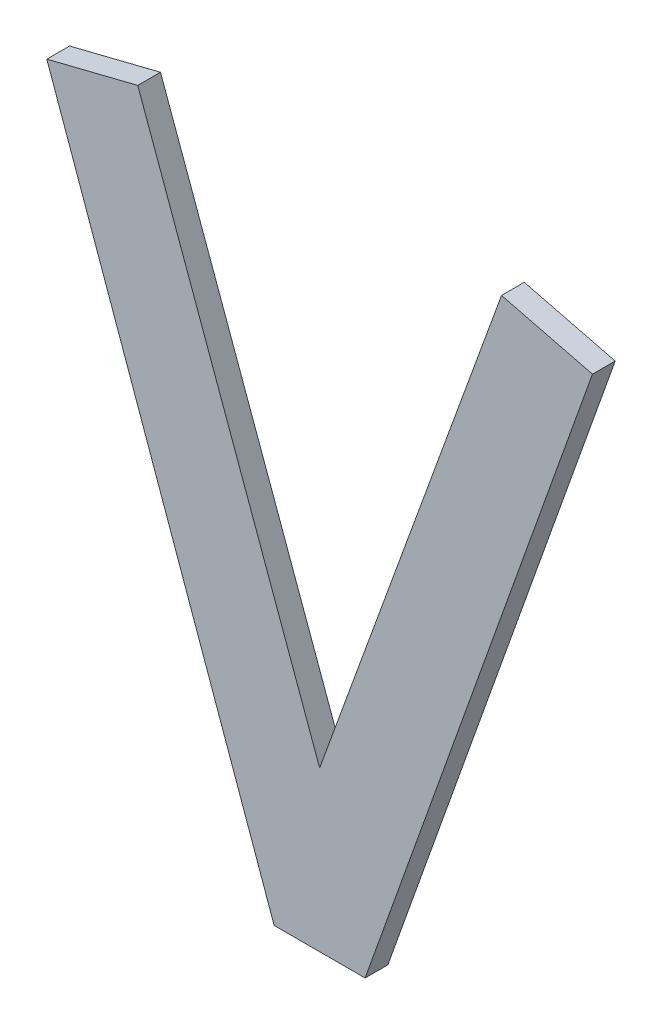
ISO-10303-21;
HEADER;
FILE_DESCRIPTION(('STEP AP214'),'2;1');
FILE_NAME('part.step','',(''),(''),'','','');
FILE_SCHEMA(('AUTOMOTIVE_DESIGN { 1 0 10303 214 1 1 1 1 }'));
ENDSEC;
DATA;
#1=APPLICATION_CONTEXT('core data for automotive mechanical design processes');
#2=APPLICATION_PROTOCOL_DEFINITION('international standard','automotive_design',2000,#1);
#3=PRODUCT_CONTEXT('',#1,'mechanical');
#4=PRODUCT('Part','Part','',(#3));
#5=PRODUCT_RELATED_PRODUCT_CATEGORY('part','',(#4));
#6=PRODUCT_DEFINITION_FORMATION('','',#4);
#7=PRODUCT_DEFINITION_CONTEXT('part definition',#1,'design');
#8=PRODUCT_DEFINITION('design','',#6,#7);
#9=PRODUCT_DEFINITION_SHAPE('','',#8);
#10=(LENGTH_UNIT() NAMED_UNIT(*) SI_UNIT(.MILLI.,.METRE.));
#11=(NAMED_UNIT(*) PLANE_ANGLE_UNIT() SI_UNIT($,.RADIAN.));
#12=(NAMED_UNIT(*) SI_UNIT($,.STERADIAN.) SOLID_ANGLE_UNIT());
#13=UNCERTAINTY_MEASURE_WITH_UNIT(LENGTH_MEASURE(1.E-05),#10,'distance_accuracy_value','');
#14=(GEOMETRIC_REPRESENTATION_CONTEXT(3) GLOBAL_UNCERTAINTY_ASSIGNED_CONTEXT((#13)) GLOBAL_UNIT_ASSIGNED_CONTEXT((#10,
#11,#12)) REPRESENTATION_CONTEXT('',''));
#15=CARTESIAN_POINT('',(0.,0.,0.));
#16=DIRECTION('',(0.,0.,1.));
#17=DIRECTION('',(1.,0.,0.));
#18=AXIS2_PLACEMENT_3D('',#15,#16,#17);
#19=CARTESIAN_POINT('',(-0.07999984,0.14500098,0.01));
#20=DIRECTION('',(0.,0.,-1.));
#21=DIRECTION('',(-1.,0.,0.));
#22=AXIS2_PLACEMENT_3D('',#19,#20,#21);
#23=PLANE('',#22);
#24=DIRECTION('',(0.336336396997966,-0.941741911594905,0.));
#25=VECTOR('',#24,1.);
#26=CARTESIAN_POINT('',(-0.01999996000001,-0.14499844,0.01));
#27=LINE('',#26,#25);
#28=CARTESIAN_POINT('',(-0.01999996000001,-0.14499844,0.01));
#29=VERTEX_POINT('',#28);
#30=CARTESIAN_POINT('',(-0.119999759999976,0.135001000000008,0.01));
#31=VERTEX_POINT('',#30);
#32=EDGE_CURVE('E126',#29,#31,#27,.F.);
#33=ORIENTED_EDGE('',*,*,#32,.F.);
#34=DIRECTION('',(1.,0.,0.));
#35=VECTOR('',#34,1.);
#36=CARTESIAN_POINT('',(0.01999995999999,-0.14499844,0.01));
#37=LINE('',#36,#35);
#38=CARTESIAN_POINT('',(0.0199999600000227,-0.144998440000012,0.01));
#39=VERTEX_POINT('',#38);
#40=EDGE_CURVE('E119',#39,#29,#37,.F.);
#41=ORIENTED_EDGE('',*,*,#40,.F.);
#42=DIRECTION('',(0.336336396997966,0.941741911594905,0.));
#43=VECTOR('',#42,1.);
#44=CARTESIAN_POINT('',(0.11999976,0.135001,0.01));
#45=LINE('',#44,#43);
#46=CARTESIAN_POINT('',(0.119999760000001,0.135001000000005,0.01));
#47=VERTEX_POINT('',#46);
#48=EDGE_CURVE('E112',#47,#39,#45,.F.);
#49=ORIENTED_EDGE('',*,*,#48,.F.);
#50=DIRECTION('',(-0.970142500145391,0.242535625036098,0.));
#51=VECTOR('',#50,1.);
#52=CARTESIAN_POINT('',(0.07999984,0.14500098,0.01));
#53=LINE('',#52,#51);
#54=CARTESIAN_POINT('',(0.079999840000047,0.145000979999983,0.01));
#55=VERTEX_POINT('',#54);
#56=EDGE_CURVE('E89',#55,#47,#53,.F.);
#57=ORIENTED_EDGE('',*,*,#56,.F.);
#58=DIRECTION('',(-0.341743063087106,-0.939793423488291,0.));
#59=VECTOR('',#58,1.);
#60=CARTESIAN_POINT('',(0.,-0.07499858,0.01));
#61=LINE('',#60,#59);
#62=CARTESIAN_POINT('',(0.,-0.0749985799999829,0.01));
#63=VERTEX_POINT('',#62);
#64=EDGE_CURVE('E73',#63,#55,#61,.F.);
#65=ORIENTED_EDGE('',*,*,#64,.F.);
#66=DIRECTION('',(-0.341743063087106,0.939793423488291,0.));
#67=VECTOR('',#66,1.);
#68=CARTESIAN_POINT('',(-0.07999984,0.14500098,0.01));
#69=LINE('',#68,#67);
#70=CARTESIAN_POINT('',(-0.07999984,0.145000979999998,0.01));
#71=VERTEX_POINT('',#70);
#72=EDGE_CURVE('E19',#71,#63,#69,.F.);
#73=ORIENTED_EDGE('',*,*,#72,.F.);
#74=DIRECTION('',(-0.970142500145391,-0.242535625036098,0.));
#75=VECTOR('',#74,1.);
#76=CARTESIAN_POINT('',(-0.11999976,0.135001,0.01));
#77=LINE('',#76,#75);
#78=EDGE_CURVE('E131',#31,#71,#77,.F.);
#79=ORIENTED_EDGE('',*,*,#78,.F.);
#80=EDGE_LOOP('',(#33,#41,#49,#57,#65,#73,#79));
#81=FACE_BOUND('',#80,.T.);
#82=ADVANCED_FACE('F16',(#81),#23,.F.);
#83=CARTESIAN_POINT('',(-0.07999984,0.14500098,0.));
#84=DIRECTION('',(0.939793423488291,0.341743063087106,0.));
#85=DIRECTION('',(-0.341743063087106,0.939793423488291,0.));
#86=AXIS2_PLACEMENT_3D('',#83,#84,#85);
#87=PLANE('',#86);
#88=DIRECTION('',(0.,0.,1.));
#89=VECTOR('',#88,1.);
#90=CARTESIAN_POINT('',(0.,-0.07499858,0.));
#91=LINE('',#90,#89);
#92=CARTESIAN_POINT('',(0.,-0.0749985799999829,0.));
#93=VERTEX_POINT('',#92);
#94=EDGE_CURVE('E79',#93,#63,#91,.T.);
#95=ORIENTED_EDGE('',*,*,#94,.F.);
#96=DIRECTION('',(0.341743063086704,-0.939793423488437,0.));
#97=VECTOR('',#96,1.);
#98=CARTESIAN_POINT('',(-0.07999984,0.14500098,0.));
#99=LINE('',#98,#97);
#100=CARTESIAN_POINT('',(-0.07999984,0.145000979999998,0.));
#101=VERTEX_POINT('',#100);
#102=EDGE_CURVE('E135',#101,#93,#99,.T.);
#103=ORIENTED_EDGE('',*,*,#102,.F.);
#104=DIRECTION('',(0.,0.,1.));
#105=VECTOR('',#104,1.);
#106=CARTESIAN_POINT('',(-0.0799998399999976,0.14500097999999,0.));
#107=LINE('',#106,#105);
#108=EDGE_CURVE('E82',#71,#101,#107,.F.);
#109=ORIENTED_EDGE('',*,*,#108,.F.);
#110=ORIENTED_EDGE('',*,*,#72,.T.);
#111=EDGE_LOOP('',(#95,#103,#109,#110));
#112=FACE_BOUND('',#111,.T.);
#113=ADVANCED_FACE('F78',(#112),#87,.T.);
#114=CARTESIAN_POINT('',(0.,-0.07499858,0.));
#115=DIRECTION('',(-0.939793423488291,0.341743063087106,0.));
#116=DIRECTION('',(-0.341743063087106,-0.939793423488291,0.));
#117=AXIS2_PLACEMENT_3D('',#114,#115,#116);
#118=PLANE('',#117);
#119=DIRECTION('',(0.,0.,1.));
#120=VECTOR('',#119,1.);
#121=CARTESIAN_POINT('',(0.07999984,0.14500098,0.));
#122=LINE('',#121,#120);
#123=CARTESIAN_POINT('',(0.079999840000047,0.145000979999983,0.));
#124=VERTEX_POINT('',#123);
#125=EDGE_CURVE('E92',#124,#55,#122,.T.);
#126=ORIENTED_EDGE('',*,*,#125,.F.);
#127=DIRECTION('',(0.341743063086704,0.939793423488437,0.));
#128=VECTOR('',#127,1.);
#129=CARTESIAN_POINT('',(0.,-0.07499858,0.));
#130=LINE('',#129,#128);
#131=EDGE_CURVE('E96',#93,#124,#130,.T.);
#132=ORIENTED_EDGE('',*,*,#131,.F.);
#133=ORIENTED_EDGE('',*,*,#94,.T.);
#134=ORIENTED_EDGE('',*,*,#64,.T.);
#135=EDGE_LOOP('',(#126,#132,#133,#134));
#136=FACE_BOUND('',#135,.T.);
#137=ADVANCED_FACE('F94',(#136),#118,.T.);
#138=CARTESIAN_POINT('',(0.07999984,0.14500098,0.));
#139=DIRECTION('',(0.242535625036098,0.970142500145391,0.));
#140=DIRECTION('',(-0.970142500145391,0.242535625036098,0.));
#141=AXIS2_PLACEMENT_3D('',#138,#139,#140);
#142=PLANE('',#141);
#143=DIRECTION('',(0.,0.,1.));
#144=VECTOR('',#143,1.);
#145=CARTESIAN_POINT('',(0.11999976,0.135001,0.));
#146=LINE('',#145,#144);
#147=CARTESIAN_POINT('',(0.119999760000001,0.135001000000005,0.));
#148=VERTEX_POINT('',#147);
#149=EDGE_CURVE('E108',#148,#47,#146,.T.);
#150=ORIENTED_EDGE('',*,*,#149,.F.);
#151=DIRECTION('',(0.970142500145332,-0.242535625036333,0.));
#152=VECTOR('',#151,1.);
#153=CARTESIAN_POINT('',(0.07999984,0.14500098,0.));
#154=LINE('',#153,#152);
#155=EDGE_CURVE('E140',#124,#148,#154,.T.);
#156=ORIENTED_EDGE('',*,*,#155,.F.);
#157=ORIENTED_EDGE('',*,*,#125,.T.);
#158=ORIENTED_EDGE('',*,*,#56,.T.);
#159=EDGE_LOOP('',(#150,#156,#157,#158));
#160=FACE_BOUND('',#159,.T.);
#161=ADVANCED_FACE('F180',(#160),#142,.T.);
#162=CARTESIAN_POINT('',(0.11999976,0.135001,0.));
#163=DIRECTION('',(0.941741911594905,-0.336336396997966,0.));
#164=DIRECTION('',(0.336336396997966,0.941741911594905,0.));
#165=AXIS2_PLACEMENT_3D('',#162,#163,#164);
#166=PLANE('',#165);
#167=DIRECTION('',(0.,0.,-1.));
#168=VECTOR('',#167,1.);
#169=CARTESIAN_POINT('',(0.01999995999999,-0.14499844,0.));
#170=LINE('',#169,#168);
#171=CARTESIAN_POINT('',(0.0199999600000226,-0.144998440000012,0.));
#172=VERTEX_POINT('',#171);
#173=EDGE_CURVE('E115',#172,#39,#170,.F.);
#174=ORIENTED_EDGE('',*,*,#173,.F.);
#175=DIRECTION('',(-0.336336396998186,-0.941741911594827,0.));
#176=VECTOR('',#175,1.);
#177=CARTESIAN_POINT('',(0.11999976,0.135001,0.));
#178=LINE('',#177,#176);
#179=EDGE_CURVE('E144',#148,#172,#178,.T.);
#180=ORIENTED_EDGE('',*,*,#179,.F.);
#181=ORIENTED_EDGE('',*,*,#149,.T.);
#182=ORIENTED_EDGE('',*,*,#48,.T.);
#183=EDGE_LOOP('',(#174,#180,#181,#182));
#184=FACE_BOUND('',#183,.T.);
#185=ADVANCED_FACE('F177',(#184),#166,.T.);
#186=CARTESIAN_POINT('',(0.01999995999999,-0.14499844,0.));
#187=DIRECTION('',(0.,-1.,0.));
#188=DIRECTION('',(0.,0.,-1.));
#189=AXIS2_PLACEMENT_3D('',#186,#187,#188);
#190=PLANE('',#189);
#191=DIRECTION('',(0.,0.,1.));
#192=VECTOR('',#191,1.);
#193=CARTESIAN_POINT('',(-0.01999996000001,-0.14499844,0.));
#194=LINE('',#193,#192);
#195=CARTESIAN_POINT('',(-0.01999996000001,-0.14499844,0.));
#196=VERTEX_POINT('',#195);
#197=EDGE_CURVE('E122',#196,#29,#194,.T.);
#198=ORIENTED_EDGE('',*,*,#197,.F.);
#199=DIRECTION('',(-1.,0.,0.));
#200=VECTOR('',#199,1.);
#201=CARTESIAN_POINT('',(-0.07999984,-0.14499844,0.));
#202=LINE('',#201,#200);
#203=EDGE_CURVE('E147',#172,#196,#202,.T.);
#204=ORIENTED_EDGE('',*,*,#203,.F.);
#205=ORIENTED_EDGE('',*,*,#173,.T.);
#206=ORIENTED_EDGE('',*,*,#40,.T.);
#207=EDGE_LOOP('',(#198,#204,#205,#206));
#208=FACE_BOUND('',#207,.T.);
#209=ADVANCED_FACE('F160',(#208),#190,.T.);
#210=CARTESIAN_POINT('',(-0.01999996000001,-0.14499844,0.));
#211=DIRECTION('',(-0.941741911594905,-0.336336396997966,0.));
#212=DIRECTION('',(0.336336396997966,-0.941741911594905,0.));
#213=AXIS2_PLACEMENT_3D('',#210,#211,#212);
#214=PLANE('',#213);
#215=DIRECTION('',(0.,0.,1.));
#216=VECTOR('',#215,1.);
#217=CARTESIAN_POINT('',(-0.11999976,0.135001,0.));
#218=LINE('',#217,#216);
#219=CARTESIAN_POINT('',(-0.119999759999976,0.135001000000009,0.));
#220=VERTEX_POINT('',#219);
#221=EDGE_CURVE('E35',#220,#31,#218,.T.);
#222=ORIENTED_EDGE('',*,*,#221,.F.);
#223=DIRECTION('',(-0.336336396998127,0.941741911594848,0.));
#224=VECTOR('',#223,1.);
#225=CARTESIAN_POINT('',(-0.01999996000001,-0.14499844,0.));
#226=LINE('',#225,#224);
#227=EDGE_CURVE('E26',#196,#220,#226,.T.);
#228=ORIENTED_EDGE('',*,*,#227,.F.);
#229=ORIENTED_EDGE('',*,*,#197,.T.);
#230=ORIENTED_EDGE('',*,*,#32,.T.);
#231=EDGE_LOOP('',(#222,#228,#229,#230));
#232=FACE_BOUND('',#231,.T.);
#233=ADVANCED_FACE('F158',(#232),#214,.T.);
#234=CARTESIAN_POINT('',(-0.11999976,0.135001,0.));
#235=DIRECTION('',(-0.242535625036098,0.970142500145391,0.));
#236=DIRECTION('',(-0.970142500145391,-0.242535625036098,0.));
#237=AXIS2_PLACEMENT_3D('',#234,#235,#236);
#238=PLANE('',#237);
#239=ORIENTED_EDGE('',*,*,#108,.T.);
#240=DIRECTION('',(0.970142500145332,0.242535625036333,0.));
#241=VECTOR('',#240,1.);
#242=CARTESIAN_POINT('',(-0.11999976,0.135001,0.));
#243=LINE('',#242,#241);
#244=EDGE_CURVE('E11',#220,#101,#243,.T.);
#245=ORIENTED_EDGE('',*,*,#244,.F.);
#246=ORIENTED_EDGE('',*,*,#221,.T.);
#247=ORIENTED_EDGE('',*,*,#78,.T.);
#248=EDGE_LOOP('',(#239,#245,#246,#247));
#249=FACE_BOUND('',#248,.T.);
#250=ADVANCED_FACE('F163',(#249),#238,.T.);
#251=CARTESIAN_POINT('',(-0.07999984,0.14500098,0.));
#252=DIRECTION('',(0.,0.,-1.));
#253=DIRECTION('',(-1.,0.,0.));
#254=AXIS2_PLACEMENT_3D('',#251,#252,#253);
#255=PLANE('',#254);
#256=ORIENTED_EDGE('',*,*,#227,.T.);
#257=ORIENTED_EDGE('',*,*,#244,.T.);
#258=ORIENTED_EDGE('',*,*,#102,.T.);
#259=ORIENTED_EDGE('',*,*,#131,.T.);
#260=ORIENTED_EDGE('',*,*,#155,.T.);
#261=ORIENTED_EDGE('',*,*,#179,.T.);
#262=ORIENTED_EDGE('',*,*,#203,.T.);
#263=EDGE_LOOP('',(#256,#257,#258,#259,#260,#261,#262));
#264=FACE_BOUND('',#263,.T.);
#265=ADVANCED_FACE('F156',(#264),#255,.T.);
#266=CLOSED_SHELL('',(#82,#113,#137,#161,#185,#209,#233,#250,#265));
#267=MANIFOLD_SOLID_BREP('B1',#266);
#268=ADVANCED_BREP_SHAPE_REPRESENTATION('',(#18,#267),#14);
#269=SHAPE_DEFINITION_REPRESENTATION(#9,#268);
ENDSEC;
END-ISO-10303-21;
